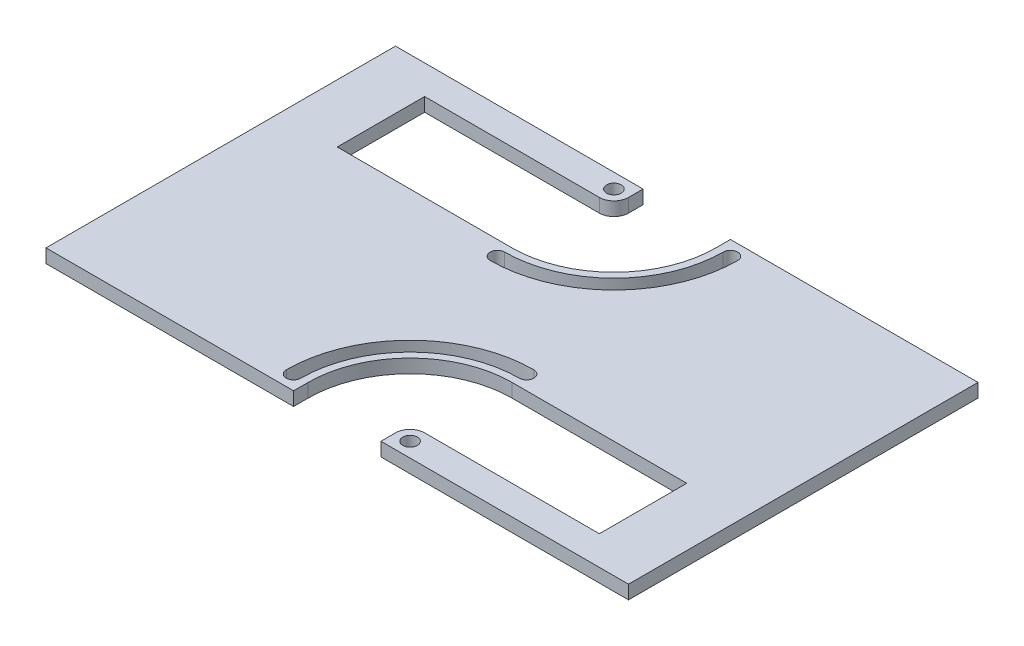
ISO-10303-21;
HEADER;
FILE_DESCRIPTION(('STEP AP214'),'2;1');
FILE_NAME('part.step','',(''),(''),'','','');
FILE_SCHEMA(('AUTOMOTIVE_DESIGN { 1 0 10303 214 1 1 1 1 }'));
ENDSEC;
DATA;
#1=APPLICATION_CONTEXT('core data for automotive mechanical design processes');
#2=APPLICATION_PROTOCOL_DEFINITION('international standard','automotive_design',2000,#1);
#3=PRODUCT_CONTEXT('',#1,'mechanical');
#4=PRODUCT('Part','Part','',(#3));
#5=PRODUCT_RELATED_PRODUCT_CATEGORY('part','',(#4));
#6=PRODUCT_DEFINITION_FORMATION('','',#4);
#7=PRODUCT_DEFINITION_CONTEXT('part definition',#1,'design');
#8=PRODUCT_DEFINITION('design','',#6,#7);
#9=PRODUCT_DEFINITION_SHAPE('','',#8);
#10=(LENGTH_UNIT() NAMED_UNIT(*) SI_UNIT(.MILLI.,.METRE.));
#11=(NAMED_UNIT(*) PLANE_ANGLE_UNIT() SI_UNIT($,.RADIAN.));
#12=(NAMED_UNIT(*) SI_UNIT($,.STERADIAN.) SOLID_ANGLE_UNIT());
#13=UNCERTAINTY_MEASURE_WITH_UNIT(LENGTH_MEASURE(1.E-05),#10,'distance_accuracy_value','');
#14=(GEOMETRIC_REPRESENTATION_CONTEXT(3) GLOBAL_UNCERTAINTY_ASSIGNED_CONTEXT((#13)) GLOBAL_UNIT_ASSIGNED_CONTEXT((#10,
#11,#12)) REPRESENTATION_CONTEXT('',''));
#15=CARTESIAN_POINT('',(0.,0.,0.));
#16=DIRECTION('',(0.,0.,1.));
#17=DIRECTION('',(1.,0.,0.));
#18=AXIS2_PLACEMENT_3D('',#15,#16,#17);
#19=CARTESIAN_POINT('',(0.,2.9718,0.));
#20=DIRECTION('',(0.,1.,0.));
#21=DIRECTION('',(0.,0.,1.));
#22=AXIS2_PLACEMENT_3D('',#19,#20,#21);
#23=PLANE('',#22);
#24=CARTESIAN_POINT('',(-12.7,2.9718,-34.925));
#25=DIRECTION('',(0.,1.,0.));
#26=DIRECTION('',(0.,0.,-1.));
#27=AXIS2_PLACEMENT_3D('',#24,#25,#26);
#28=CIRCLE('',#27,1.5875);
#29=CARTESIAN_POINT('',(-12.7,2.9718,-36.5125));
#30=VERTEX_POINT('',#29);
#31=EDGE_CURVE('E448',#30,#30,#28,.T.);
#32=ORIENTED_EDGE('',*,*,#31,.F.);
#33=EDGE_LOOP('',(#32));
#34=FACE_BOUND('',#33,.T.);
#35=CARTESIAN_POINT('',(12.7,2.9718,34.925));
#36=DIRECTION('',(0.,1.,0.));
#37=DIRECTION('',(0.,0.,1.));
#38=AXIS2_PLACEMENT_3D('',#35,#36,#37);
#39=CIRCLE('',#38,1.5875);
#40=CARTESIAN_POINT('',(12.7,2.9718,36.5125));
#41=VERTEX_POINT('',#40);
#42=EDGE_CURVE('E538',#41,#41,#39,.T.);
#43=ORIENTED_EDGE('',*,*,#42,.F.);
#44=EDGE_LOOP('',(#43));
#45=FACE_BOUND('',#44,.T.);
#46=CARTESIAN_POINT('',(12.7000000000001,2.9718,9.52499999999998));
#47=DIRECTION('',(0.,1.,0.));
#48=DIRECTION('',(0.,0.,1.));
#49=AXIS2_PLACEMENT_3D('',#46,#47,#48);
#50=CIRCLE('',#49,1.5875);
#51=CARTESIAN_POINT('',(12.7000000000001,2.9718,11.1125));
#52=VERTEX_POINT('',#51);
#53=CARTESIAN_POINT('',(12.7000000000001,2.9718,7.93749999999998));
#54=VERTEX_POINT('',#53);
#55=EDGE_CURVE('E653',#52,#54,#50,.T.);
#56=ORIENTED_EDGE('',*,*,#55,.F.);
#57=CARTESIAN_POINT('',(12.7,2.9718,34.925));
#58=DIRECTION('',(0.,1.,0.));
#59=DIRECTION('',(0.,0.,1.));
#60=AXIS2_PLACEMENT_3D('',#57,#58,#59);
#61=CIRCLE('',#60,23.8125);
#62=CARTESIAN_POINT('',(-11.1125,2.9718,34.925));
#63=VERTEX_POINT('',#62);
#64=EDGE_CURVE('E611',#52,#63,#61,.T.);
#65=ORIENTED_EDGE('',*,*,#64,.T.);
#66=CARTESIAN_POINT('',(-12.7,2.9718,34.925));
#67=DIRECTION('',(0.,1.,0.));
#68=DIRECTION('',(0.,0.,1.));
#69=AXIS2_PLACEMENT_3D('',#66,#67,#68);
#70=CIRCLE('',#69,1.5875);
#71=CARTESIAN_POINT('',(-14.2875,2.9718,34.925));
#72=VERTEX_POINT('',#71);
#73=EDGE_CURVE('E637',#72,#63,#70,.T.);
#74=ORIENTED_EDGE('',*,*,#73,.F.);
#75=CARTESIAN_POINT('',(12.7,2.9718,34.925));
#76=DIRECTION('',(0.,1.,0.));
#77=DIRECTION('',(0.,0.,1.));
#78=AXIS2_PLACEMENT_3D('',#75,#76,#77);
#79=CIRCLE('',#78,26.9875);
#80=EDGE_CURVE('E657',#54,#72,#79,.T.);
#81=ORIENTED_EDGE('',*,*,#80,.F.);
#82=EDGE_LOOP('',(#56,#65,#74,#81));
#83=FACE_BOUND('',#82,.T.);
#84=CARTESIAN_POINT('',(-12.7000000000001,2.9718,-9.52499999999998));
#85=DIRECTION('',(0.,1.,0.));
#86=DIRECTION('',(0.,0.,-1.));
#87=AXIS2_PLACEMENT_3D('',#84,#85,#86);
#88=CIRCLE('',#87,1.5875);
#89=CARTESIAN_POINT('',(-12.7000000000001,2.9718,-11.1125));
#90=VERTEX_POINT('',#89);
#91=CARTESIAN_POINT('',(-12.7000000000001,2.9718,-7.93749999999998));
#92=VERTEX_POINT('',#91);
#93=EDGE_CURVE('E524',#90,#92,#88,.T.);
#94=ORIENTED_EDGE('',*,*,#93,.F.);
#95=CARTESIAN_POINT('',(-12.7,2.9718,-34.925));
#96=DIRECTION('',(0.,1.,0.));
#97=DIRECTION('',(0.,0.,-1.));
#98=AXIS2_PLACEMENT_3D('',#95,#96,#97);
#99=CIRCLE('',#98,23.8125);
#100=CARTESIAN_POINT('',(11.1125,2.9718,-34.925));
#101=VERTEX_POINT('',#100);
#102=EDGE_CURVE('E218',#90,#101,#99,.T.);
#103=ORIENTED_EDGE('',*,*,#102,.T.);
#104=CARTESIAN_POINT('',(12.7,2.9718,-34.925));
#105=DIRECTION('',(0.,1.,0.));
#106=DIRECTION('',(0.,0.,-1.));
#107=AXIS2_PLACEMENT_3D('',#104,#105,#106);
#108=CIRCLE('',#107,1.5875);
#109=CARTESIAN_POINT('',(14.2875,2.9718,-34.925));
#110=VERTEX_POINT('',#109);
#111=EDGE_CURVE('E511',#110,#101,#108,.T.);
#112=ORIENTED_EDGE('',*,*,#111,.F.);
#113=CARTESIAN_POINT('',(-12.7,2.9718,-34.925));
#114=DIRECTION('',(0.,1.,0.));
#115=DIRECTION('',(0.,0.,-1.));
#116=AXIS2_PLACEMENT_3D('',#113,#114,#115);
#117=CIRCLE('',#116,26.9875);
#118=EDGE_CURVE('E528',#92,#110,#117,.T.);
#119=ORIENTED_EDGE('',*,*,#118,.F.);
#120=EDGE_LOOP('',(#94,#103,#112,#119));
#121=FACE_BOUND('',#120,.T.);
#122=CARTESIAN_POINT('',(-12.7,2.9718,-34.925));
#123=DIRECTION('',(0.,1.,0.));
#124=DIRECTION('',(0.,0.,-1.));
#125=AXIS2_PLACEMENT_3D('',#122,#123,#124);
#126=CIRCLE('',#125,3.175);
#127=CARTESIAN_POINT('',(-12.7,2.9718,-31.75));
#128=VERTEX_POINT('',#127);
#129=CARTESIAN_POINT('',(-9.52500000000002,2.9718,-34.925));
#130=VERTEX_POINT('',#129);
#131=EDGE_CURVE('E420',#128,#130,#126,.T.);
#132=ORIENTED_EDGE('',*,*,#131,.T.);
#133=DIRECTION('',(0.,0.,-1.));
#134=VECTOR('',#133,1.);
#135=CARTESIAN_POINT('',(-9.52499999999998,2.9718,0.));
#136=LINE('',#135,#134);
#137=CARTESIAN_POINT('',(-9.52500000000002,2.9718,-38.1));
#138=VERTEX_POINT('',#137);
#139=EDGE_CURVE('E441',#130,#138,#136,.T.);
#140=ORIENTED_EDGE('',*,*,#139,.T.);
#141=DIRECTION('',(-1.,0.,0.));
#142=VECTOR('',#141,1.);
#143=CARTESIAN_POINT('',(-63.5,2.9718,-38.1));
#144=LINE('',#143,#142);
#145=CARTESIAN_POINT('',(-63.5,2.9718,-38.1));
#146=VERTEX_POINT('',#145);
#147=EDGE_CURVE('E681',#138,#146,#144,.T.);
#148=ORIENTED_EDGE('',*,*,#147,.T.);
#149=DIRECTION('',(0.,0.,1.));
#150=VECTOR('',#149,1.);
#151=CARTESIAN_POINT('',(-63.5,2.9718,-38.1));
#152=LINE('',#151,#150);
#153=CARTESIAN_POINT('',(-63.5,2.9718,38.1));
#154=VERTEX_POINT('',#153);
#155=EDGE_CURVE('E687',#146,#154,#152,.T.);
#156=ORIENTED_EDGE('',*,*,#155,.T.);
#157=DIRECTION('',(1.,0.,0.));
#158=VECTOR('',#157,1.);
#159=CARTESIAN_POINT('',(-63.5,2.9718,38.1));
#160=LINE('',#159,#158);
#161=CARTESIAN_POINT('',(-9.52499999999998,2.9718,38.1));
#162=VERTEX_POINT('',#161);
#163=EDGE_CURVE('E691',#154,#162,#160,.T.);
#164=ORIENTED_EDGE('',*,*,#163,.T.);
#165=DIRECTION('',(0.,0.,1.));
#166=VECTOR('',#165,1.);
#167=CARTESIAN_POINT('',(-9.52499999999998,2.9718,0.));
#168=LINE('',#167,#166);
#169=CARTESIAN_POINT('',(-9.52499999999998,2.9718,34.925));
#170=VERTEX_POINT('',#169);
#171=EDGE_CURVE('E601',#170,#162,#168,.T.);
#172=ORIENTED_EDGE('',*,*,#171,.F.);
#173=CARTESIAN_POINT('',(12.7,2.9718,34.925));
#174=DIRECTION('',(0.,1.,0.));
#175=DIRECTION('',(0.,0.,1.));
#176=AXIS2_PLACEMENT_3D('',#173,#174,#175);
#177=CIRCLE('',#176,22.225);
#178=CARTESIAN_POINT('',(12.7000000000001,2.9718,12.7));
#179=VERTEX_POINT('',#178);
#180=EDGE_CURVE('E597',#179,#170,#177,.T.);
#181=ORIENTED_EDGE('',*,*,#180,.F.);
#182=DIRECTION('',(1.,0.,0.));
#183=VECTOR('',#182,1.);
#184=CARTESIAN_POINT('',(0.,2.9718,12.6999999999999));
#185=LINE('',#184,#183);
#186=CARTESIAN_POINT('',(50.8000000000001,2.9718,12.7000000000001));
#187=VERTEX_POINT('',#186);
#188=EDGE_CURVE('E593',#179,#187,#185,.T.);
#189=ORIENTED_EDGE('',*,*,#188,.T.);
#190=DIRECTION('',(0.,0.,-1.));
#191=VECTOR('',#190,1.);
#192=CARTESIAN_POINT('',(50.8000000000001,2.9718,1.48029736616688E-13));
#193=LINE('',#192,#191);
#194=CARTESIAN_POINT('',(50.8,2.9718,31.7500000000001));
#195=VERTEX_POINT('',#194);
#196=EDGE_CURVE('E589',#195,#187,#193,.T.);
#197=ORIENTED_EDGE('',*,*,#196,.F.);
#198=DIRECTION('',(1.,0.,0.));
#199=VECTOR('',#198,1.);
#200=CARTESIAN_POINT('',(-1.04083408558608E-13,2.9718,31.7499999999999));
#201=LINE('',#200,#199);
#202=CARTESIAN_POINT('',(12.7,2.9718,31.75));
#203=VERTEX_POINT('',#202);
#204=EDGE_CURVE('E585',#203,#195,#201,.T.);
#205=ORIENTED_EDGE('',*,*,#204,.F.);
#206=CARTESIAN_POINT('',(12.7,2.9718,34.925));
#207=DIRECTION('',(0.,1.,0.));
#208=DIRECTION('',(0.,0.,1.));
#209=AXIS2_PLACEMENT_3D('',#206,#207,#208);
#210=CIRCLE('',#209,3.175);
#211=CARTESIAN_POINT('',(9.52500000000002,2.9718,34.925));
#212=VERTEX_POINT('',#211);
#213=EDGE_CURVE('E551',#203,#212,#210,.T.);
#214=ORIENTED_EDGE('',*,*,#213,.T.);
#215=DIRECTION('',(0.,0.,1.));
#216=VECTOR('',#215,1.);
#217=CARTESIAN_POINT('',(9.52499999999998,2.9718,0.));
#218=LINE('',#217,#216);
#219=CARTESIAN_POINT('',(9.52500000000002,2.9718,38.1));
#220=VERTEX_POINT('',#219);
#221=EDGE_CURVE('E559',#212,#220,#218,.T.);
#222=ORIENTED_EDGE('',*,*,#221,.T.);
#223=CARTESIAN_POINT('',(63.5,2.9718,38.1));
#224=VERTEX_POINT('',#223);
#225=EDGE_CURVE('E690',#220,#224,#160,.T.);
#226=ORIENTED_EDGE('',*,*,#225,.T.);
#227=DIRECTION('',(0.,0.,-1.));
#228=VECTOR('',#227,1.);
#229=CARTESIAN_POINT('',(63.5,2.9718,-38.1));
#230=LINE('',#229,#228);
#231=CARTESIAN_POINT('',(63.5,2.9718,-38.1));
#232=VERTEX_POINT('',#231);
#233=EDGE_CURVE('E677',#224,#232,#230,.T.);
#234=ORIENTED_EDGE('',*,*,#233,.T.);
#235=CARTESIAN_POINT('',(9.52499999999998,2.9718,-38.1));
#236=VERTEX_POINT('',#235);
#237=EDGE_CURVE('E683',#232,#236,#144,.T.);
#238=ORIENTED_EDGE('',*,*,#237,.T.);
#239=DIRECTION('',(0.,0.,-1.));
#240=VECTOR('',#239,1.);
#241=CARTESIAN_POINT('',(9.52499999999998,2.9718,0.));
#242=LINE('',#241,#240);
#243=CARTESIAN_POINT('',(9.52499999999998,2.9718,-34.925));
#244=VERTEX_POINT('',#243);
#245=EDGE_CURVE('E445',#244,#236,#242,.T.);
#246=ORIENTED_EDGE('',*,*,#245,.F.);
#247=CARTESIAN_POINT('',(-12.7,2.9718,-34.925));
#248=DIRECTION('',(0.,1.,0.));
#249=DIRECTION('',(0.,0.,-1.));
#250=AXIS2_PLACEMENT_3D('',#247,#248,#249);
#251=CIRCLE('',#250,22.225);
#252=CARTESIAN_POINT('',(-12.7000000000001,2.9718,-12.7));
#253=VERTEX_POINT('',#252);
#254=EDGE_CURVE('E480',#253,#244,#251,.T.);
#255=ORIENTED_EDGE('',*,*,#254,.F.);
#256=DIRECTION('',(-1.,0.,0.));
#257=VECTOR('',#256,1.);
#258=CARTESIAN_POINT('',(0.,2.9718,-12.6999999999999));
#259=LINE('',#258,#257);
#260=CARTESIAN_POINT('',(-50.8000000000001,2.9718,-12.7000000000001));
#261=VERTEX_POINT('',#260);
#262=EDGE_CURVE('E476',#253,#261,#259,.T.);
#263=ORIENTED_EDGE('',*,*,#262,.T.);
#264=DIRECTION('',(0.,0.,1.));
#265=VECTOR('',#264,1.);
#266=CARTESIAN_POINT('',(-50.8000000000001,2.9718,-1.48029736616688E-13));
#267=LINE('',#266,#265);
#268=CARTESIAN_POINT('',(-50.8,2.9718,-31.7500000000001));
#269=VERTEX_POINT('',#268);
#270=EDGE_CURVE('E472',#269,#261,#267,.T.);
#271=ORIENTED_EDGE('',*,*,#270,.F.);
#272=DIRECTION('',(-1.,0.,0.));
#273=VECTOR('',#272,1.);
#274=CARTESIAN_POINT('',(1.04083408558608E-13,2.9718,-31.7499999999999));
#275=LINE('',#274,#273);
#276=EDGE_CURVE('E468',#128,#269,#275,.T.);
#277=ORIENTED_EDGE('',*,*,#276,.F.);
#278=EDGE_LOOP('',(#132,#140,#148,#156,#164,#172,#181,#189,#197,#205,#214,#222,#226,#234,#238,
#246,#255,#263,#271,#277));
#279=FACE_BOUND('',#278,.T.);
#280=ADVANCED_FACE('F199',(#34,#45,#83,#121,#279),#23,.T.);
#281=CARTESIAN_POINT('',(0.,0.,0.));
#282=DIRECTION('',(0.,1.,0.));
#283=DIRECTION('',(0.,0.,1.));
#284=AXIS2_PLACEMENT_3D('',#281,#282,#283);
#285=PLANE('',#284);
#286=CARTESIAN_POINT('',(-12.7,0.,-34.925));
#287=DIRECTION('',(0.,1.,0.));
#288=DIRECTION('',(0.,0.,-1.));
#289=AXIS2_PLACEMENT_3D('',#286,#287,#288);
#290=CIRCLE('',#289,23.8125);
#291=CARTESIAN_POINT('',(-12.7000000000001,0.,-11.1125));
#292=VERTEX_POINT('',#291);
#293=CARTESIAN_POINT('',(11.1125,0.,-34.925));
#294=VERTEX_POINT('',#293);
#295=EDGE_CURVE('E507',#292,#294,#290,.T.);
#296=ORIENTED_EDGE('',*,*,#295,.F.);
#297=CARTESIAN_POINT('',(-12.7000000000001,0.,-9.52499999999998));
#298=DIRECTION('',(0.,1.,0.));
#299=DIRECTION('',(0.,0.,-1.));
#300=AXIS2_PLACEMENT_3D('',#297,#298,#299);
#301=CIRCLE('',#300,1.5875);
#302=CARTESIAN_POINT('',(-12.7000000000001,0.,-7.93749999999998));
#303=VERTEX_POINT('',#302);
#304=EDGE_CURVE('E510',#292,#303,#301,.T.);
#305=ORIENTED_EDGE('',*,*,#304,.T.);
#306=CARTESIAN_POINT('',(-12.7,0.,-34.925));
#307=DIRECTION('',(0.,1.,0.));
#308=DIRECTION('',(0.,0.,-1.));
#309=AXIS2_PLACEMENT_3D('',#306,#307,#308);
#310=CIRCLE('',#309,26.9875);
#311=CARTESIAN_POINT('',(14.2875,0.,-34.925));
#312=VERTEX_POINT('',#311);
#313=EDGE_CURVE('E227',#303,#312,#310,.T.);
#314=ORIENTED_EDGE('',*,*,#313,.T.);
#315=CARTESIAN_POINT('',(12.7,0.,-34.925));
#316=DIRECTION('',(0.,1.,0.));
#317=DIRECTION('',(0.,0.,-1.));
#318=AXIS2_PLACEMENT_3D('',#315,#316,#317);
#319=CIRCLE('',#318,1.5875);
#320=EDGE_CURVE('E517',#312,#294,#319,.T.);
#321=ORIENTED_EDGE('',*,*,#320,.T.);
#322=EDGE_LOOP('',(#296,#305,#314,#321));
#323=FACE_BOUND('',#322,.T.);
#324=CARTESIAN_POINT('',(12.7,0.,34.925));
#325=DIRECTION('',(0.,1.,0.));
#326=DIRECTION('',(0.,0.,1.));
#327=AXIS2_PLACEMENT_3D('',#324,#325,#326);
#328=CIRCLE('',#327,23.8125);
#329=CARTESIAN_POINT('',(12.7000000000001,0.,11.1125));
#330=VERTEX_POINT('',#329);
#331=CARTESIAN_POINT('',(-11.1125,0.,34.925));
#332=VERTEX_POINT('',#331);
#333=EDGE_CURVE('E633',#330,#332,#328,.T.);
#334=ORIENTED_EDGE('',*,*,#333,.F.);
#335=CARTESIAN_POINT('',(12.7000000000001,0.,9.52499999999998));
#336=DIRECTION('',(0.,1.,0.));
#337=DIRECTION('',(0.,0.,1.));
#338=AXIS2_PLACEMENT_3D('',#335,#336,#337);
#339=CIRCLE('',#338,1.5875);
#340=CARTESIAN_POINT('',(12.7000000000001,0.,7.93749999999998));
#341=VERTEX_POINT('',#340);
#342=EDGE_CURVE('E636',#330,#341,#339,.T.);
#343=ORIENTED_EDGE('',*,*,#342,.T.);
#344=CARTESIAN_POINT('',(12.7,0.,34.925));
#345=DIRECTION('',(0.,1.,0.));
#346=DIRECTION('',(0.,0.,1.));
#347=AXIS2_PLACEMENT_3D('',#344,#345,#346);
#348=CIRCLE('',#347,26.9875);
#349=CARTESIAN_POINT('',(-14.2875,0.,34.925));
#350=VERTEX_POINT('',#349);
#351=EDGE_CURVE('E641',#341,#350,#348,.T.);
#352=ORIENTED_EDGE('',*,*,#351,.T.);
#353=CARTESIAN_POINT('',(-12.7,0.,34.925));
#354=DIRECTION('',(0.,1.,0.));
#355=DIRECTION('',(0.,0.,1.));
#356=AXIS2_PLACEMENT_3D('',#353,#354,#355);
#357=CIRCLE('',#356,1.5875);
#358=EDGE_CURVE('E645',#350,#332,#357,.T.);
#359=ORIENTED_EDGE('',*,*,#358,.T.);
#360=EDGE_LOOP('',(#334,#343,#352,#359));
#361=FACE_BOUND('',#360,.T.);
#362=CARTESIAN_POINT('',(12.7,0.,34.925));
#363=DIRECTION('',(0.,1.,0.));
#364=DIRECTION('',(0.,0.,1.));
#365=AXIS2_PLACEMENT_3D('',#362,#363,#364);
#366=CIRCLE('',#365,1.5875);
#367=CARTESIAN_POINT('',(12.7,0.,36.5125));
#368=VERTEX_POINT('',#367);
#369=EDGE_CURVE('E547',#368,#368,#366,.T.);
#370=ORIENTED_EDGE('',*,*,#369,.T.);
#371=EDGE_LOOP('',(#370));
#372=FACE_BOUND('',#371,.T.);
#373=CARTESIAN_POINT('',(-12.7,0.,-34.925));
#374=DIRECTION('',(0.,1.,0.));
#375=DIRECTION('',(0.,0.,-1.));
#376=AXIS2_PLACEMENT_3D('',#373,#374,#375);
#377=CIRCLE('',#376,1.5875);
#378=CARTESIAN_POINT('',(-12.7,0.,-36.5125));
#379=VERTEX_POINT('',#378);
#380=EDGE_CURVE('E469',#379,#379,#377,.T.);
#381=ORIENTED_EDGE('',*,*,#380,.T.);
#382=EDGE_LOOP('',(#381));
#383=FACE_BOUND('',#382,.T.);
#384=DIRECTION('',(0.,0.,-1.));
#385=VECTOR('',#384,1.);
#386=CARTESIAN_POINT('',(-9.52499999999998,0.,0.));
#387=LINE('',#386,#385);
#388=CARTESIAN_POINT('',(-9.52500000000002,0.,-34.925));
#389=VERTEX_POINT('',#388);
#390=CARTESIAN_POINT('',(-9.52500000000002,0.,-38.1));
#391=VERTEX_POINT('',#390);
#392=EDGE_CURVE('E426',#389,#391,#387,.T.);
#393=ORIENTED_EDGE('',*,*,#392,.F.);
#394=CARTESIAN_POINT('',(-12.7,0.,-34.925));
#395=DIRECTION('',(0.,1.,0.));
#396=DIRECTION('',(0.,0.,-1.));
#397=AXIS2_PLACEMENT_3D('',#394,#395,#396);
#398=CIRCLE('',#397,3.175);
#399=CARTESIAN_POINT('',(-12.7,0.,-31.75));
#400=VERTEX_POINT('',#399);
#401=EDGE_CURVE('E417',#400,#389,#398,.T.);
#402=ORIENTED_EDGE('',*,*,#401,.F.);
#403=DIRECTION('',(-1.,0.,0.));
#404=VECTOR('',#403,1.);
#405=CARTESIAN_POINT('',(1.04083408558608E-13,0.,-31.7499999999999));
#406=LINE('',#405,#404);
#407=CARTESIAN_POINT('',(-50.8,0.,-31.7500000000001));
#408=VERTEX_POINT('',#407);
#409=EDGE_CURVE('E429',#400,#408,#406,.T.);
#410=ORIENTED_EDGE('',*,*,#409,.T.);
#411=DIRECTION('',(0.,0.,1.));
#412=VECTOR('',#411,1.);
#413=CARTESIAN_POINT('',(-50.8000000000001,0.,-1.48029736616688E-13));
#414=LINE('',#413,#412);
#415=CARTESIAN_POINT('',(-50.8000000000001,0.,-12.7000000000001));
#416=VERTEX_POINT('',#415);
#417=EDGE_CURVE('E435',#408,#416,#414,.T.);
#418=ORIENTED_EDGE('',*,*,#417,.T.);
#419=DIRECTION('',(-1.,0.,0.));
#420=VECTOR('',#419,1.);
#421=CARTESIAN_POINT('',(0.,0.,-12.6999999999999));
#422=LINE('',#421,#420);
#423=CARTESIAN_POINT('',(-12.7000000000001,0.,-12.7));
#424=VERTEX_POINT('',#423);
#425=EDGE_CURVE('E453',#424,#416,#422,.T.);
#426=ORIENTED_EDGE('',*,*,#425,.F.);
#427=CARTESIAN_POINT('',(-12.7,0.,-34.925));
#428=DIRECTION('',(0.,1.,0.));
#429=DIRECTION('',(0.,0.,-1.));
#430=AXIS2_PLACEMENT_3D('',#427,#428,#429);
#431=CIRCLE('',#430,22.225);
#432=CARTESIAN_POINT('',(9.52499999999998,0.,-34.925));
#433=VERTEX_POINT('',#432);
#434=EDGE_CURVE('E456',#424,#433,#431,.T.);
#435=ORIENTED_EDGE('',*,*,#434,.T.);
#436=DIRECTION('',(0.,0.,-1.));
#437=VECTOR('',#436,1.);
#438=CARTESIAN_POINT('',(9.52499999999998,0.,0.));
#439=LINE('',#438,#437);
#440=CARTESIAN_POINT('',(9.52499999999998,0.,-38.1));
#441=VERTEX_POINT('',#440);
#442=EDGE_CURVE('E460',#433,#441,#439,.T.);
#443=ORIENTED_EDGE('',*,*,#442,.T.);
#444=DIRECTION('',(-1.,0.,0.));
#445=VECTOR('',#444,1.);
#446=CARTESIAN_POINT('',(-63.5,0.,-38.1));
#447=LINE('',#446,#445);
#448=CARTESIAN_POINT('',(63.5,0.,-38.1));
#449=VERTEX_POINT('',#448);
#450=EDGE_CURVE('E700',#449,#441,#447,.T.);
#451=ORIENTED_EDGE('',*,*,#450,.F.);
#452=DIRECTION('',(0.,0.,-1.));
#453=VECTOR('',#452,1.);
#454=CARTESIAN_POINT('',(63.5,0.,-38.1));
#455=LINE('',#454,#453);
#456=CARTESIAN_POINT('',(63.5,0.,38.1));
#457=VERTEX_POINT('',#456);
#458=EDGE_CURVE('E667',#457,#449,#455,.T.);
#459=ORIENTED_EDGE('',*,*,#458,.F.);
#460=DIRECTION('',(1.,0.,0.));
#461=VECTOR('',#460,1.);
#462=CARTESIAN_POINT('',(-63.5,0.,38.1));
#463=LINE('',#462,#461);
#464=CARTESIAN_POINT('',(9.52500000000002,0.,38.1));
#465=VERTEX_POINT('',#464);
#466=EDGE_CURVE('E707',#465,#457,#463,.T.);
#467=ORIENTED_EDGE('',*,*,#466,.F.);
#468=DIRECTION('',(0.,0.,1.));
#469=VECTOR('',#468,1.);
#470=CARTESIAN_POINT('',(9.52499999999998,0.,0.));
#471=LINE('',#470,#469);
#472=CARTESIAN_POINT('',(9.52500000000002,0.,34.925));
#473=VERTEX_POINT('',#472);
#474=EDGE_CURVE('E578',#473,#465,#471,.T.);
#475=ORIENTED_EDGE('',*,*,#474,.F.);
#476=CARTESIAN_POINT('',(12.7,0.,34.925));
#477=DIRECTION('',(0.,1.,0.));
#478=DIRECTION('',(0.,0.,1.));
#479=AXIS2_PLACEMENT_3D('',#476,#477,#478);
#480=CIRCLE('',#479,3.175);
#481=CARTESIAN_POINT('',(12.7,0.,31.75));
#482=VERTEX_POINT('',#481);
#483=EDGE_CURVE('E555',#482,#473,#480,.T.);
#484=ORIENTED_EDGE('',*,*,#483,.F.);
#485=DIRECTION('',(1.,0.,0.));
#486=VECTOR('',#485,1.);
#487=CARTESIAN_POINT('',(-1.04083408558608E-13,0.,31.7499999999999));
#488=LINE('',#487,#486);
#489=CARTESIAN_POINT('',(50.8,0.,31.7500000000001));
#490=VERTEX_POINT('',#489);
#491=EDGE_CURVE('E558',#482,#490,#488,.T.);
#492=ORIENTED_EDGE('',*,*,#491,.T.);
#493=DIRECTION('',(0.,0.,-1.));
#494=VECTOR('',#493,1.);
#495=CARTESIAN_POINT('',(50.8000000000001,0.,1.48029736616688E-13));
#496=LINE('',#495,#494);
#497=CARTESIAN_POINT('',(50.8000000000001,0.,12.7000000000001));
#498=VERTEX_POINT('',#497);
#499=EDGE_CURVE('E563',#490,#498,#496,.T.);
#500=ORIENTED_EDGE('',*,*,#499,.T.);
#501=DIRECTION('',(1.,0.,0.));
#502=VECTOR('',#501,1.);
#503=CARTESIAN_POINT('',(0.,0.,12.6999999999999));
#504=LINE('',#503,#502);
#505=CARTESIAN_POINT('',(12.7000000000001,0.,12.7));
#506=VERTEX_POINT('',#505);
#507=EDGE_CURVE('E567',#506,#498,#504,.T.);
#508=ORIENTED_EDGE('',*,*,#507,.F.);
#509=CARTESIAN_POINT('',(12.7,0.,34.925));
#510=DIRECTION('',(0.,1.,0.));
#511=DIRECTION('',(0.,0.,1.));
#512=AXIS2_PLACEMENT_3D('',#509,#510,#511);
#513=CIRCLE('',#512,22.225);
#514=CARTESIAN_POINT('',(-9.52499999999998,0.,34.925));
#515=VERTEX_POINT('',#514);
#516=EDGE_CURVE('E570',#506,#515,#513,.T.);
#517=ORIENTED_EDGE('',*,*,#516,.T.);
#518=DIRECTION('',(0.,0.,1.));
#519=VECTOR('',#518,1.);
#520=CARTESIAN_POINT('',(-9.52499999999998,0.,0.));
#521=LINE('',#520,#519);
#522=CARTESIAN_POINT('',(-9.52499999999998,0.,38.1));
#523=VERTEX_POINT('',#522);
#524=EDGE_CURVE('E574',#515,#523,#521,.T.);
#525=ORIENTED_EDGE('',*,*,#524,.T.);
#526=CARTESIAN_POINT('',(-63.5,0.,38.1));
#527=VERTEX_POINT('',#526);
#528=EDGE_CURVE('E682',#527,#523,#463,.T.);
#529=ORIENTED_EDGE('',*,*,#528,.F.);
#530=DIRECTION('',(0.,0.,1.));
#531=VECTOR('',#530,1.);
#532=CARTESIAN_POINT('',(-63.5,0.,-38.1));
#533=LINE('',#532,#531);
#534=CARTESIAN_POINT('',(-63.5,0.,-38.1));
#535=VERTEX_POINT('',#534);
#536=EDGE_CURVE('E704',#535,#527,#533,.T.);
#537=ORIENTED_EDGE('',*,*,#536,.F.);
#538=EDGE_CURVE('E699',#391,#535,#447,.T.);
#539=ORIENTED_EDGE('',*,*,#538,.F.);
#540=EDGE_LOOP('',(#393,#402,#410,#418,#426,#435,#443,#451,#459,#467,#475,#484,#492,#500,#508,
#517,#525,#529,#537,#539));
#541=FACE_BOUND('',#540,.T.);
#542=ADVANCED_FACE('F438',(#323,#361,#372,#383,#541),#285,.F.);
#543=CARTESIAN_POINT('',(-63.5,2.9718,-38.1));
#544=DIRECTION('',(0.,0.,1.));
#545=DIRECTION('',(1.,0.,0.));
#546=AXIS2_PLACEMENT_3D('',#543,#544,#545);
#547=PLANE('',#546);
#548=DIRECTION('',(0.,1.,0.));
#549=VECTOR('',#548,1.);
#550=CARTESIAN_POINT('',(-9.52500000000002,0.,-38.1));
#551=LINE('',#550,#549);
#552=EDGE_CURVE('E489',#391,#138,#551,.T.);
#553=ORIENTED_EDGE('',*,*,#552,.F.);
#554=ORIENTED_EDGE('',*,*,#538,.T.);
#555=DIRECTION('',(0.,-1.,0.));
#556=VECTOR('',#555,1.);
#557=CARTESIAN_POINT('',(-63.5,2.9718,-38.1));
#558=LINE('',#557,#556);
#559=EDGE_CURVE('E208',#146,#535,#558,.T.);
#560=ORIENTED_EDGE('',*,*,#559,.F.);
#561=ORIENTED_EDGE('',*,*,#147,.F.);
#562=EDGE_LOOP('',(#553,#554,#560,#561));
#563=FACE_BOUND('',#562,.T.);
#564=ADVANCED_FACE('F739',(#563),#547,.F.);
#565=CARTESIAN_POINT('',(-63.5,2.9718,38.1));
#566=DIRECTION('',(0.,0.,-1.));
#567=DIRECTION('',(-1.,0.,0.));
#568=AXIS2_PLACEMENT_3D('',#565,#566,#567);
#569=PLANE('',#568);
#570=DIRECTION('',(0.,1.,0.));
#571=VECTOR('',#570,1.);
#572=CARTESIAN_POINT('',(9.52500000000002,0.,38.1));
#573=LINE('',#572,#571);
#574=EDGE_CURVE('E612',#465,#220,#573,.T.);
#575=ORIENTED_EDGE('',*,*,#574,.F.);
#576=ORIENTED_EDGE('',*,*,#466,.T.);
#577=DIRECTION('',(0.,-1.,0.));
#578=VECTOR('',#577,1.);
#579=CARTESIAN_POINT('',(63.5,2.9718,38.1));
#580=LINE('',#579,#578);
#581=EDGE_CURVE('E695',#224,#457,#580,.T.);
#582=ORIENTED_EDGE('',*,*,#581,.F.);
#583=ORIENTED_EDGE('',*,*,#225,.F.);
#584=EDGE_LOOP('',(#575,#576,#582,#583));
#585=FACE_BOUND('',#584,.T.);
#586=ADVANCED_FACE('F770',(#585),#569,.F.);
#587=CARTESIAN_POINT('',(63.5,2.9718,-38.1));
#588=DIRECTION('',(-1.,0.,0.));
#589=DIRECTION('',(0.,0.,1.));
#590=AXIS2_PLACEMENT_3D('',#587,#588,#589);
#591=PLANE('',#590);
#592=ORIENTED_EDGE('',*,*,#458,.T.);
#593=DIRECTION('',(0.,-1.,0.));
#594=VECTOR('',#593,1.);
#595=CARTESIAN_POINT('',(63.5,2.9718,-38.1));
#596=LINE('',#595,#594);
#597=EDGE_CURVE('E12',#232,#449,#596,.T.);
#598=ORIENTED_EDGE('',*,*,#597,.F.);
#599=ORIENTED_EDGE('',*,*,#233,.F.);
#600=ORIENTED_EDGE('',*,*,#581,.T.);
#601=EDGE_LOOP('',(#592,#598,#599,#600));
#602=FACE_BOUND('',#601,.T.);
#603=ADVANCED_FACE('F201',(#602),#591,.F.);
#604=ORIENTED_EDGE('',*,*,#450,.T.);
#605=DIRECTION('',(0.,1.,0.));
#606=VECTOR('',#605,1.);
#607=CARTESIAN_POINT('',(9.52499999999998,0.,-38.1));
#608=LINE('',#607,#606);
#609=EDGE_CURVE('E492',#441,#236,#608,.T.);
#610=ORIENTED_EDGE('',*,*,#609,.T.);
#611=ORIENTED_EDGE('',*,*,#237,.F.);
#612=ORIENTED_EDGE('',*,*,#597,.T.);
#613=EDGE_LOOP('',(#604,#610,#611,#612));
#614=FACE_BOUND('',#613,.T.);
#615=ADVANCED_FACE('F760',(#614),#547,.F.);
#616=CARTESIAN_POINT('',(-63.5,2.9718,-38.1));
#617=DIRECTION('',(1.,0.,0.));
#618=DIRECTION('',(0.,0.,-1.));
#619=AXIS2_PLACEMENT_3D('',#616,#617,#618);
#620=PLANE('',#619);
#621=ORIENTED_EDGE('',*,*,#536,.T.);
#622=DIRECTION('',(0.,-1.,0.));
#623=VECTOR('',#622,1.);
#624=CARTESIAN_POINT('',(-63.5,2.9718,38.1));
#625=LINE('',#624,#623);
#626=EDGE_CURVE('E714',#154,#527,#625,.T.);
#627=ORIENTED_EDGE('',*,*,#626,.F.);
#628=ORIENTED_EDGE('',*,*,#155,.F.);
#629=ORIENTED_EDGE('',*,*,#559,.T.);
#630=EDGE_LOOP('',(#621,#627,#628,#629));
#631=FACE_BOUND('',#630,.T.);
#632=ADVANCED_FACE('F723',(#631),#620,.F.);
#633=ORIENTED_EDGE('',*,*,#528,.T.);
#634=DIRECTION('',(0.,1.,0.));
#635=VECTOR('',#634,1.);
#636=CARTESIAN_POINT('',(-9.52499999999998,0.,38.1));
#637=LINE('',#636,#635);
#638=EDGE_CURVE('E615',#523,#162,#637,.T.);
#639=ORIENTED_EDGE('',*,*,#638,.T.);
#640=ORIENTED_EDGE('',*,*,#163,.F.);
#641=ORIENTED_EDGE('',*,*,#626,.T.);
#642=EDGE_LOOP('',(#633,#639,#640,#641));
#643=FACE_BOUND('',#642,.T.);
#644=ADVANCED_FACE('F730',(#643),#569,.F.);
#645=CARTESIAN_POINT('',(12.7,0.,34.925));
#646=DIRECTION('',(0.,1.,0.));
#647=DIRECTION('',(0.,0.,1.));
#648=AXIS2_PLACEMENT_3D('',#645,#646,#647);
#649=CYLINDRICAL_SURFACE('',#648,23.8125);
#650=ORIENTED_EDGE('',*,*,#64,.F.);
#651=DIRECTION('',(0.,1.,0.));
#652=VECTOR('',#651,1.);
#653=CARTESIAN_POINT('',(12.7000000000001,0.,11.1125));
#654=LINE('',#653,#652);
#655=EDGE_CURVE('E649',#330,#52,#654,.T.);
#656=ORIENTED_EDGE('',*,*,#655,.F.);
#657=ORIENTED_EDGE('',*,*,#333,.T.);
#658=DIRECTION('',(0.,1.,0.));
#659=VECTOR('',#658,1.);
#660=CARTESIAN_POINT('',(-11.1125,0.,34.925));
#661=LINE('',#660,#659);
#662=EDGE_CURVE('E664',#332,#63,#661,.T.);
#663=ORIENTED_EDGE('',*,*,#662,.T.);
#664=EDGE_LOOP('',(#650,#656,#657,#663));
#665=FACE_BOUND('',#664,.T.);
#666=ADVANCED_FACE('F815',(#665),#649,.T.);
#667=CARTESIAN_POINT('',(-12.7,0.,34.925));
#668=DIRECTION('',(0.,1.,0.));
#669=DIRECTION('',(0.,0.,1.));
#670=AXIS2_PLACEMENT_3D('',#667,#668,#669);
#671=CYLINDRICAL_SURFACE('',#670,1.5875);
#672=ORIENTED_EDGE('',*,*,#73,.T.);
#673=ORIENTED_EDGE('',*,*,#662,.F.);
#674=ORIENTED_EDGE('',*,*,#358,.F.);
#675=DIRECTION('',(0.,1.,0.));
#676=VECTOR('',#675,1.);
#677=CARTESIAN_POINT('',(-14.2875,0.,34.925));
#678=LINE('',#677,#676);
#679=EDGE_CURVE('E668',#350,#72,#678,.T.);
#680=ORIENTED_EDGE('',*,*,#679,.T.);
#681=EDGE_LOOP('',(#672,#673,#674,#680));
#682=FACE_BOUND('',#681,.T.);
#683=ADVANCED_FACE('F856',(#682),#671,.F.);
#684=CARTESIAN_POINT('',(12.7,0.,34.925));
#685=DIRECTION('',(0.,1.,0.));
#686=DIRECTION('',(0.,0.,1.));
#687=AXIS2_PLACEMENT_3D('',#684,#685,#686);
#688=CYLINDRICAL_SURFACE('',#687,26.9875);
#689=ORIENTED_EDGE('',*,*,#80,.T.);
#690=ORIENTED_EDGE('',*,*,#679,.F.);
#691=ORIENTED_EDGE('',*,*,#351,.F.);
#692=DIRECTION('',(0.,1.,0.));
#693=VECTOR('',#692,1.);
#694=CARTESIAN_POINT('',(12.7000000000001,0.,7.93749999999998));
#695=LINE('',#694,#693);
#696=EDGE_CURVE('E671',#341,#54,#695,.T.);
#697=ORIENTED_EDGE('',*,*,#696,.T.);
#698=EDGE_LOOP('',(#689,#690,#691,#697));
#699=FACE_BOUND('',#698,.T.);
#700=ADVANCED_FACE('F864',(#699),#688,.F.);
#701=CARTESIAN_POINT('',(12.7000000000001,0.,9.52499999999998));
#702=DIRECTION('',(0.,1.,0.));
#703=DIRECTION('',(0.,0.,1.));
#704=AXIS2_PLACEMENT_3D('',#701,#702,#703);
#705=CYLINDRICAL_SURFACE('',#704,1.5875);
#706=ORIENTED_EDGE('',*,*,#55,.T.);
#707=ORIENTED_EDGE('',*,*,#696,.F.);
#708=ORIENTED_EDGE('',*,*,#342,.F.);
#709=ORIENTED_EDGE('',*,*,#655,.T.);
#710=EDGE_LOOP('',(#706,#707,#708,#709));
#711=FACE_BOUND('',#710,.T.);
#712=ADVANCED_FACE('F872',(#711),#705,.F.);
#713=CARTESIAN_POINT('',(12.7,0.,34.925));
#714=DIRECTION('',(0.,1.,0.));
#715=DIRECTION('',(0.,0.,1.));
#716=AXIS2_PLACEMENT_3D('',#713,#714,#715);
#717=CYLINDRICAL_SURFACE('',#716,1.5875);
#718=ORIENTED_EDGE('',*,*,#369,.F.);
#719=EDGE_LOOP('',(#718));
#720=FACE_BOUND('',#719,.T.);
#721=ORIENTED_EDGE('',*,*,#42,.T.);
#722=EDGE_LOOP('',(#721));
#723=FACE_BOUND('',#722,.T.);
#724=ADVANCED_FACE('F878',(#720,#723),#717,.F.);
#725=CARTESIAN_POINT('',(12.7,0.,34.925));
#726=DIRECTION('',(0.,1.,0.));
#727=DIRECTION('',(0.,0.,1.));
#728=AXIS2_PLACEMENT_3D('',#725,#726,#727);
#729=CYLINDRICAL_SURFACE('',#728,3.175);
#730=ORIENTED_EDGE('',*,*,#213,.F.);
#731=DIRECTION('',(0.,1.,0.));
#732=VECTOR('',#731,1.);
#733=CARTESIAN_POINT('',(12.7,0.,31.75));
#734=LINE('',#733,#732);
#735=EDGE_CURVE('E581',#482,#203,#734,.T.);
#736=ORIENTED_EDGE('',*,*,#735,.F.);
#737=ORIENTED_EDGE('',*,*,#483,.T.);
#738=DIRECTION('',(0.,1.,0.));
#739=VECTOR('',#738,1.);
#740=CARTESIAN_POINT('',(9.52500000000002,0.,34.925));
#741=LINE('',#740,#739);
#742=EDGE_CURVE('E607',#473,#212,#741,.T.);
#743=ORIENTED_EDGE('',*,*,#742,.T.);
#744=EDGE_LOOP('',(#730,#736,#737,#743));
#745=FACE_BOUND('',#744,.T.);
#746=ADVANCED_FACE('F779',(#745),#729,.T.);
#747=CARTESIAN_POINT('',(9.52499999999998,0.,0.));
#748=DIRECTION('',(-1.,0.,0.));
#749=DIRECTION('',(0.,0.,1.));
#750=AXIS2_PLACEMENT_3D('',#747,#748,#749);
#751=PLANE('',#750);
#752=ORIENTED_EDGE('',*,*,#221,.F.);
#753=ORIENTED_EDGE('',*,*,#742,.F.);
#754=ORIENTED_EDGE('',*,*,#474,.T.);
#755=ORIENTED_EDGE('',*,*,#574,.T.);
#756=EDGE_LOOP('',(#752,#753,#754,#755));
#757=FACE_BOUND('',#756,.T.);
#758=ADVANCED_FACE('F773',(#757),#751,.T.);
#759=CARTESIAN_POINT('',(-9.52499999999998,0.,0.));
#760=DIRECTION('',(-1.,0.,0.));
#761=DIRECTION('',(0.,0.,1.));
#762=AXIS2_PLACEMENT_3D('',#759,#760,#761);
#763=PLANE('',#762);
#764=ORIENTED_EDGE('',*,*,#171,.T.);
#765=ORIENTED_EDGE('',*,*,#638,.F.);
#766=ORIENTED_EDGE('',*,*,#524,.F.);
#767=DIRECTION('',(0.,1.,0.));
#768=VECTOR('',#767,1.);
#769=CARTESIAN_POINT('',(-9.52499999999998,0.,34.925));
#770=LINE('',#769,#768);
#771=EDGE_CURVE('E619',#515,#170,#770,.T.);
#772=ORIENTED_EDGE('',*,*,#771,.T.);
#773=EDGE_LOOP('',(#764,#765,#766,#772));
#774=FACE_BOUND('',#773,.T.);
#775=ADVANCED_FACE('F795',(#774),#763,.F.);
#776=CARTESIAN_POINT('',(12.7,0.,34.925));
#777=DIRECTION('',(0.,1.,0.));
#778=DIRECTION('',(0.,0.,1.));
#779=AXIS2_PLACEMENT_3D('',#776,#777,#778);
#780=CYLINDRICAL_SURFACE('',#779,22.225);
#781=ORIENTED_EDGE('',*,*,#180,.T.);
#782=ORIENTED_EDGE('',*,*,#771,.F.);
#783=ORIENTED_EDGE('',*,*,#516,.F.);
#784=DIRECTION('',(0.,1.,0.));
#785=VECTOR('',#784,1.);
#786=CARTESIAN_POINT('',(12.7000000000001,0.,12.7));
#787=LINE('',#786,#785);
#788=EDGE_CURVE('E622',#506,#179,#787,.T.);
#789=ORIENTED_EDGE('',*,*,#788,.T.);
#790=EDGE_LOOP('',(#781,#782,#783,#789));
#791=FACE_BOUND('',#790,.T.);
#792=ADVANCED_FACE('F793',(#791),#780,.F.);
#793=CARTESIAN_POINT('',(0.,0.,12.6999999999999));
#794=DIRECTION('',(0.,0.,1.));
#795=DIRECTION('',(1.,0.,0.));
#796=AXIS2_PLACEMENT_3D('',#793,#794,#795);
#797=PLANE('',#796);
#798=ORIENTED_EDGE('',*,*,#188,.F.);
#799=ORIENTED_EDGE('',*,*,#788,.F.);
#800=ORIENTED_EDGE('',*,*,#507,.T.);
#801=DIRECTION('',(0.,1.,0.));
#802=VECTOR('',#801,1.);
#803=CARTESIAN_POINT('',(50.8000000000001,0.,12.7000000000001));
#804=LINE('',#803,#802);
#805=EDGE_CURVE('E625',#498,#187,#804,.T.);
#806=ORIENTED_EDGE('',*,*,#805,.T.);
#807=EDGE_LOOP('',(#798,#799,#800,#806));
#808=FACE_BOUND('',#807,.T.);
#809=ADVANCED_FACE('F790',(#808),#797,.T.);
#810=CARTESIAN_POINT('',(50.8000000000001,0.,1.48029736616688E-13));
#811=DIRECTION('',(1.,0.,0.));
#812=DIRECTION('',(0.,0.,-1.));
#813=AXIS2_PLACEMENT_3D('',#810,#811,#812);
#814=PLANE('',#813);
#815=ORIENTED_EDGE('',*,*,#196,.T.);
#816=ORIENTED_EDGE('',*,*,#805,.F.);
#817=ORIENTED_EDGE('',*,*,#499,.F.);
#818=DIRECTION('',(0.,1.,0.));
#819=VECTOR('',#818,1.);
#820=CARTESIAN_POINT('',(50.8,0.,31.7500000000001));
#821=LINE('',#820,#819);
#822=EDGE_CURVE('E628',#490,#195,#821,.T.);
#823=ORIENTED_EDGE('',*,*,#822,.T.);
#824=EDGE_LOOP('',(#815,#816,#817,#823));
#825=FACE_BOUND('',#824,.T.);
#826=ADVANCED_FACE('F786',(#825),#814,.F.);
#827=CARTESIAN_POINT('',(-1.04083408558608E-13,0.,31.7499999999999));
#828=DIRECTION('',(0.,0.,1.));
#829=DIRECTION('',(1.,0.,0.));
#830=AXIS2_PLACEMENT_3D('',#827,#828,#829);
#831=PLANE('',#830);
#832=ORIENTED_EDGE('',*,*,#204,.T.);
#833=ORIENTED_EDGE('',*,*,#822,.F.);
#834=ORIENTED_EDGE('',*,*,#491,.F.);
#835=ORIENTED_EDGE('',*,*,#735,.T.);
#836=EDGE_LOOP('',(#832,#833,#834,#835));
#837=FACE_BOUND('',#836,.T.);
#838=ADVANCED_FACE('F784',(#837),#831,.F.);
#839=CARTESIAN_POINT('',(-12.7,0.,-34.925));
#840=DIRECTION('',(0.,1.,0.));
#841=DIRECTION('',(0.,0.,1.));
#842=AXIS2_PLACEMENT_3D('',#839,#840,#841);
#843=CYLINDRICAL_SURFACE('',#842,3.175);
#844=ORIENTED_EDGE('',*,*,#131,.F.);
#845=DIRECTION('',(0.,1.,0.));
#846=VECTOR('',#845,1.);
#847=CARTESIAN_POINT('',(-12.7,0.,-31.75));
#848=LINE('',#847,#846);
#849=EDGE_CURVE('E412',#400,#128,#848,.T.);
#850=ORIENTED_EDGE('',*,*,#849,.F.);
#851=ORIENTED_EDGE('',*,*,#401,.T.);
#852=DIRECTION('',(0.,1.,0.));
#853=VECTOR('',#852,1.);
#854=CARTESIAN_POINT('',(-9.52500000000002,0.,-34.925));
#855=LINE('',#854,#853);
#856=EDGE_CURVE('E486',#389,#130,#855,.T.);
#857=ORIENTED_EDGE('',*,*,#856,.T.);
#858=EDGE_LOOP('',(#844,#850,#851,#857));
#859=FACE_BOUND('',#858,.T.);
#860=ADVANCED_FACE('F414',(#859),#843,.T.);
#861=CARTESIAN_POINT('',(-9.52499999999998,0.,0.));
#862=DIRECTION('',(1.,0.,0.));
#863=DIRECTION('',(0.,0.,-1.));
#864=AXIS2_PLACEMENT_3D('',#861,#862,#863);
#865=PLANE('',#864);
#866=ORIENTED_EDGE('',*,*,#139,.F.);
#867=ORIENTED_EDGE('',*,*,#856,.F.);
#868=ORIENTED_EDGE('',*,*,#392,.T.);
#869=ORIENTED_EDGE('',*,*,#552,.T.);
#870=EDGE_LOOP('',(#866,#867,#868,#869));
#871=FACE_BOUND('',#870,.T.);
#872=ADVANCED_FACE('F741',(#871),#865,.T.);
#873=CARTESIAN_POINT('',(9.52499999999998,0.,0.));
#874=DIRECTION('',(1.,0.,0.));
#875=DIRECTION('',(0.,0.,-1.));
#876=AXIS2_PLACEMENT_3D('',#873,#874,#875);
#877=PLANE('',#876);
#878=ORIENTED_EDGE('',*,*,#245,.T.);
#879=ORIENTED_EDGE('',*,*,#609,.F.);
#880=ORIENTED_EDGE('',*,*,#442,.F.);
#881=DIRECTION('',(0.,1.,0.));
#882=VECTOR('',#881,1.);
#883=CARTESIAN_POINT('',(9.52499999999998,0.,-34.925));
#884=LINE('',#883,#882);
#885=EDGE_CURVE('E496',#433,#244,#884,.T.);
#886=ORIENTED_EDGE('',*,*,#885,.T.);
#887=EDGE_LOOP('',(#878,#879,#880,#886));
#888=FACE_BOUND('',#887,.T.);
#889=ADVANCED_FACE('F757',(#888),#877,.F.);
#890=CARTESIAN_POINT('',(-12.7,0.,-34.925));
#891=DIRECTION('',(0.,1.,0.));
#892=DIRECTION('',(0.,0.,1.));
#893=AXIS2_PLACEMENT_3D('',#890,#891,#892);
#894=CYLINDRICAL_SURFACE('',#893,22.225);
#895=ORIENTED_EDGE('',*,*,#254,.T.);
#896=ORIENTED_EDGE('',*,*,#885,.F.);
#897=ORIENTED_EDGE('',*,*,#434,.F.);
#898=DIRECTION('',(0.,1.,0.));
#899=VECTOR('',#898,1.);
#900=CARTESIAN_POINT('',(-12.7000000000001,0.,-12.7));
#901=LINE('',#900,#899);
#902=EDGE_CURVE('E499',#424,#253,#901,.T.);
#903=ORIENTED_EDGE('',*,*,#902,.T.);
#904=EDGE_LOOP('',(#895,#896,#897,#903));
#905=FACE_BOUND('',#904,.T.);
#906=ADVANCED_FACE('F753',(#905),#894,.F.);
#907=CARTESIAN_POINT('',(0.,0.,-12.6999999999999));
#908=DIRECTION('',(0.,0.,-1.));
#909=DIRECTION('',(-1.,0.,0.));
#910=AXIS2_PLACEMENT_3D('',#907,#908,#909);
#911=PLANE('',#910);
#912=ORIENTED_EDGE('',*,*,#262,.F.);
#913=ORIENTED_EDGE('',*,*,#902,.F.);
#914=ORIENTED_EDGE('',*,*,#425,.T.);
#915=DIRECTION('',(0.,1.,0.));
#916=VECTOR('',#915,1.);
#917=CARTESIAN_POINT('',(-50.8000000000001,0.,-12.7000000000001));
#918=LINE('',#917,#916);
#919=EDGE_CURVE('E502',#416,#261,#918,.T.);
#920=ORIENTED_EDGE('',*,*,#919,.T.);
#921=EDGE_LOOP('',(#912,#913,#914,#920));
#922=FACE_BOUND('',#921,.T.);
#923=ADVANCED_FACE('F751',(#922),#911,.T.);
#924=CARTESIAN_POINT('',(-50.8000000000001,0.,-1.48029736616688E-13));
#925=DIRECTION('',(-1.,0.,0.));
#926=DIRECTION('',(0.,0.,1.));
#927=AXIS2_PLACEMENT_3D('',#924,#925,#926);
#928=PLANE('',#927);
#929=ORIENTED_EDGE('',*,*,#270,.T.);
#930=ORIENTED_EDGE('',*,*,#919,.F.);
#931=ORIENTED_EDGE('',*,*,#417,.F.);
#932=DIRECTION('',(0.,1.,0.));
#933=VECTOR('',#932,1.);
#934=CARTESIAN_POINT('',(-50.8,0.,-31.7500000000001));
#935=LINE('',#934,#933);
#936=EDGE_CURVE('E425',#408,#269,#935,.T.);
#937=ORIENTED_EDGE('',*,*,#936,.T.);
#938=EDGE_LOOP('',(#929,#930,#931,#937));
#939=FACE_BOUND('',#938,.T.);
#940=ADVANCED_FACE('F747',(#939),#928,.F.);
#941=CARTESIAN_POINT('',(1.04083408558608E-13,0.,-31.7499999999999));
#942=DIRECTION('',(0.,0.,-1.));
#943=DIRECTION('',(-1.,0.,0.));
#944=AXIS2_PLACEMENT_3D('',#941,#942,#943);
#945=PLANE('',#944);
#946=ORIENTED_EDGE('',*,*,#276,.T.);
#947=ORIENTED_EDGE('',*,*,#936,.F.);
#948=ORIENTED_EDGE('',*,*,#409,.F.);
#949=ORIENTED_EDGE('',*,*,#849,.T.);
#950=EDGE_LOOP('',(#946,#947,#948,#949));
#951=FACE_BOUND('',#950,.T.);
#952=ADVANCED_FACE('F430',(#951),#945,.F.);
#953=CARTESIAN_POINT('',(-12.7,0.,-34.925));
#954=DIRECTION('',(0.,1.,0.));
#955=DIRECTION('',(0.,0.,1.));
#956=AXIS2_PLACEMENT_3D('',#953,#954,#955);
#957=CYLINDRICAL_SURFACE('',#956,23.8125);
#958=ORIENTED_EDGE('',*,*,#102,.F.);
#959=DIRECTION('',(0.,1.,0.));
#960=VECTOR('',#959,1.);
#961=CARTESIAN_POINT('',(-12.7000000000001,0.,-11.1125));
#962=LINE('',#961,#960);
#963=EDGE_CURVE('E521',#292,#90,#962,.T.);
#964=ORIENTED_EDGE('',*,*,#963,.F.);
#965=ORIENTED_EDGE('',*,*,#295,.T.);
#966=DIRECTION('',(0.,1.,0.));
#967=VECTOR('',#966,1.);
#968=CARTESIAN_POINT('',(11.1125,0.,-34.925));
#969=LINE('',#968,#967);
#970=EDGE_CURVE('E535',#294,#101,#969,.T.);
#971=ORIENTED_EDGE('',*,*,#970,.T.);
#972=EDGE_LOOP('',(#958,#964,#965,#971));
#973=FACE_BOUND('',#972,.T.);
#974=ADVANCED_FACE('F1002',(#973),#957,.T.);
#975=CARTESIAN_POINT('',(12.7,0.,-34.925));
#976=DIRECTION('',(0.,1.,0.));
#977=DIRECTION('',(0.,0.,1.));
#978=AXIS2_PLACEMENT_3D('',#975,#976,#977);
#979=CYLINDRICAL_SURFACE('',#978,1.5875);
#980=ORIENTED_EDGE('',*,*,#111,.T.);
#981=ORIENTED_EDGE('',*,*,#970,.F.);
#982=ORIENTED_EDGE('',*,*,#320,.F.);
#983=DIRECTION('',(0.,1.,0.));
#984=VECTOR('',#983,1.);
#985=CARTESIAN_POINT('',(14.2875,0.,-34.925));
#986=LINE('',#985,#984);
#987=EDGE_CURVE('E539',#312,#110,#986,.T.);
#988=ORIENTED_EDGE('',*,*,#987,.T.);
#989=EDGE_LOOP('',(#980,#981,#982,#988));
#990=FACE_BOUND('',#989,.T.);
#991=ADVANCED_FACE('F1011',(#990),#979,.F.);
#992=CARTESIAN_POINT('',(-12.7,0.,-34.925));
#993=DIRECTION('',(0.,1.,0.));
#994=DIRECTION('',(0.,0.,1.));
#995=AXIS2_PLACEMENT_3D('',#992,#993,#994);
#996=CYLINDRICAL_SURFACE('',#995,26.9875);
#997=ORIENTED_EDGE('',*,*,#118,.T.);
#998=ORIENTED_EDGE('',*,*,#987,.F.);
#999=ORIENTED_EDGE('',*,*,#313,.F.);
#1000=DIRECTION('',(0.,1.,0.));
#1001=VECTOR('',#1000,1.);
#1002=CARTESIAN_POINT('',(-12.7000000000001,0.,-7.93749999999998));
#1003=LINE('',#1002,#1001);
#1004=EDGE_CURVE('E542',#303,#92,#1003,.T.);
#1005=ORIENTED_EDGE('',*,*,#1004,.T.);
#1006=EDGE_LOOP('',(#997,#998,#999,#1005));
#1007=FACE_BOUND('',#1006,.T.);
#1008=ADVANCED_FACE('F1020',(#1007),#996,.F.);
#1009=CARTESIAN_POINT('',(-12.7000000000001,0.,-9.52499999999998));
#1010=DIRECTION('',(0.,1.,0.));
#1011=DIRECTION('',(0.,0.,1.));
#1012=AXIS2_PLACEMENT_3D('',#1009,#1010,#1011);
#1013=CYLINDRICAL_SURFACE('',#1012,1.5875);
#1014=ORIENTED_EDGE('',*,*,#93,.T.);
#1015=ORIENTED_EDGE('',*,*,#1004,.F.);
#1016=ORIENTED_EDGE('',*,*,#304,.F.);
#1017=ORIENTED_EDGE('',*,*,#963,.T.);
#1018=EDGE_LOOP('',(#1014,#1015,#1016,#1017));
#1019=FACE_BOUND('',#1018,.T.);
#1020=ADVANCED_FACE('F1030',(#1019),#1013,.F.);
#1021=CARTESIAN_POINT('',(-12.7,0.,-34.925));
#1022=DIRECTION('',(0.,1.,0.));
#1023=DIRECTION('',(0.,0.,1.));
#1024=AXIS2_PLACEMENT_3D('',#1021,#1022,#1023);
#1025=CYLINDRICAL_SURFACE('',#1024,1.5875);
#1026=ORIENTED_EDGE('',*,*,#380,.F.);
#1027=EDGE_LOOP('',(#1026));
#1028=FACE_BOUND('',#1027,.T.);
#1029=ORIENTED_EDGE('',*,*,#31,.T.);
#1030=EDGE_LOOP('',(#1029));
#1031=FACE_BOUND('',#1030,.T.);
#1032=ADVANCED_FACE('F1039',(#1028,#1031),#1025,.F.);
#1033=CLOSED_SHELL('',(#280,#542,#564,#586,#603,#615,#632,#644,#666,#683,#700,#712,#724,#746,
#758,#775,#792,#809,#826,#838,#860,#872,#889,#906,#923,#940,#952,#974,#991,#1008,#1020,#1032));
#1034=MANIFOLD_SOLID_BREP('B2',#1033);
#1035=ADVANCED_BREP_SHAPE_REPRESENTATION('',(#18,#1034),#14);
#1036=SHAPE_DEFINITION_REPRESENTATION(#9,#1035);
ENDSEC;
END-ISO-10303-21;
